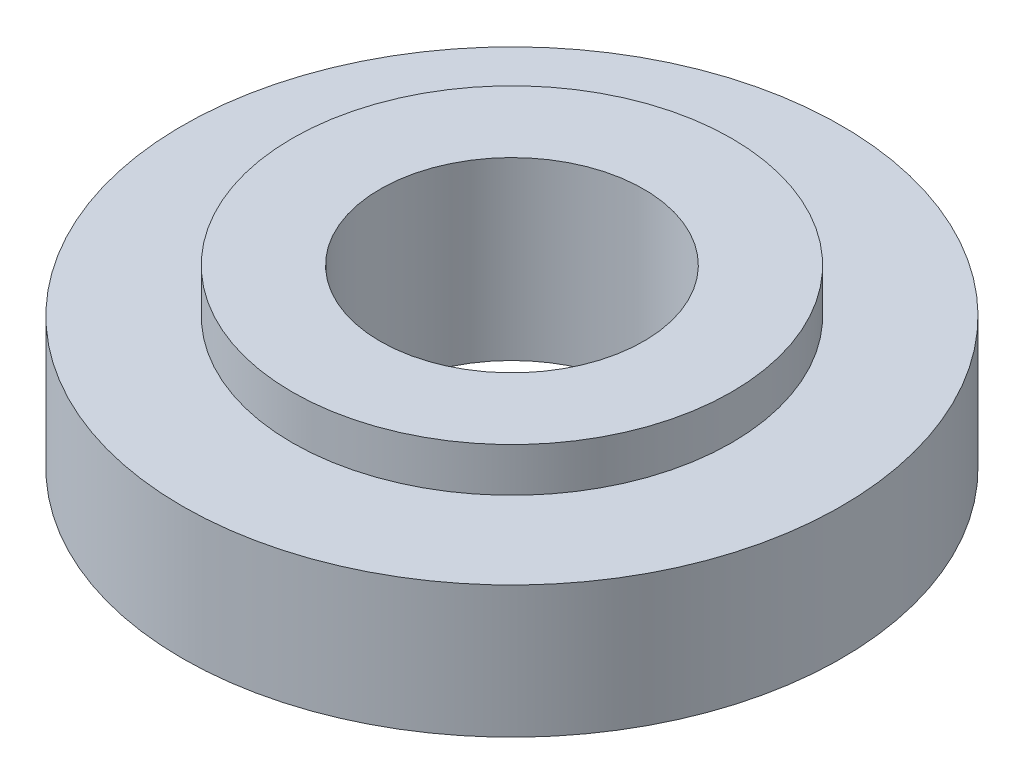
ISO-10303-21;
HEADER;
FILE_DESCRIPTION(('STEP AP214'),'2;1');
FILE_NAME('part.step','',(''),(''),'','','');
FILE_SCHEMA(('AUTOMOTIVE_DESIGN { 1 0 10303 214 1 1 1 1 }'));
ENDSEC;
DATA;
#1=APPLICATION_CONTEXT('core data for automotive mechanical design processes');
#2=APPLICATION_PROTOCOL_DEFINITION('international standard','automotive_design',2000,#1);
#3=PRODUCT_CONTEXT('',#1,'mechanical');
#4=PRODUCT('Part','Part','',(#3));
#5=PRODUCT_RELATED_PRODUCT_CATEGORY('part','',(#4));
#6=PRODUCT_DEFINITION_FORMATION('','',#4);
#7=PRODUCT_DEFINITION_CONTEXT('part definition',#1,'design');
#8=PRODUCT_DEFINITION('design','',#6,#7);
#9=PRODUCT_DEFINITION_SHAPE('','',#8);
#10=(LENGTH_UNIT() NAMED_UNIT(*) SI_UNIT(.MILLI.,.METRE.));
#11=(NAMED_UNIT(*) PLANE_ANGLE_UNIT() SI_UNIT($,.RADIAN.));
#12=(NAMED_UNIT(*) SI_UNIT($,.STERADIAN.) SOLID_ANGLE_UNIT());
#13=UNCERTAINTY_MEASURE_WITH_UNIT(LENGTH_MEASURE(1.E-05),#10,'distance_accuracy_value','');
#14=(GEOMETRIC_REPRESENTATION_CONTEXT(3) GLOBAL_UNCERTAINTY_ASSIGNED_CONTEXT((#13)) GLOBAL_UNIT_ASSIGNED_CONTEXT((#10,
#11,#12)) REPRESENTATION_CONTEXT('',''));
#15=CARTESIAN_POINT('',(0.,0.,0.));
#16=DIRECTION('',(0.,0.,1.));
#17=DIRECTION('',(1.,0.,0.));
#18=AXIS2_PLACEMENT_3D('',#15,#16,#17);
#19=CARTESIAN_POINT('',(0.,-2.06790134706815,0.));
#20=DIRECTION('',(0.,1.,0.));
#21=DIRECTION('',(0.,0.,1.));
#22=AXIS2_PLACEMENT_3D('',#19,#20,#21);
#23=CYLINDRICAL_SURFACE('',#22,2.5005);
#24=CARTESIAN_POINT('',(0.,-2.06790134706815,0.));
#25=DIRECTION('',(0.,1.,0.));
#26=DIRECTION('',(0.,0.,1.));
#27=AXIS2_PLACEMENT_3D('',#24,#25,#26);
#28=CIRCLE('',#27,2.5005);
#29=CARTESIAN_POINT('',(0.,-2.06790134706815,2.5005));
#30=VERTEX_POINT('',#29);
#31=EDGE_CURVE('E46',#30,#30,#28,.T.);
#32=ORIENTED_EDGE('',*,*,#31,.F.);
#33=EDGE_LOOP('',(#32));
#34=FACE_BOUND('',#33,.T.);
#35=CARTESIAN_POINT('',(0.,1.26609865293185,0.));
#36=DIRECTION('',(0.,1.,0.));
#37=DIRECTION('',(0.,0.,1.));
#38=AXIS2_PLACEMENT_3D('',#35,#36,#37);
#39=CIRCLE('',#38,2.5005);
#40=CARTESIAN_POINT('',(0.,1.26609865293185,2.5005));
#41=VERTEX_POINT('',#40);
#42=EDGE_CURVE('E57',#41,#41,#39,.T.);
#43=ORIENTED_EDGE('',*,*,#42,.T.);
#44=EDGE_LOOP('',(#43));
#45=FACE_BOUND('',#44,.T.);
#46=ADVANCED_FACE('F38',(#34,#45),#23,.F.);
#47=CARTESIAN_POINT('',(0.,-2.06790134706815,0.));
#48=DIRECTION('',(0.,1.,0.));
#49=DIRECTION('',(0.,0.,1.));
#50=AXIS2_PLACEMENT_3D('',#47,#48,#49);
#51=CYLINDRICAL_SURFACE('',#50,6.25125);
#52=CARTESIAN_POINT('',(0.,-2.06790134706815,0.));
#53=DIRECTION('',(0.,1.,0.));
#54=DIRECTION('',(0.,0.,1.));
#55=AXIS2_PLACEMENT_3D('',#52,#53,#54);
#56=CIRCLE('',#55,6.25125);
#57=CARTESIAN_POINT('',(0.,-2.06790134706815,6.25125));
#58=VERTEX_POINT('',#57);
#59=EDGE_CURVE('E10',#58,#58,#56,.T.);
#60=ORIENTED_EDGE('',*,*,#59,.T.);
#61=EDGE_LOOP('',(#60));
#62=FACE_BOUND('',#61,.T.);
#63=CARTESIAN_POINT('',(0.,0.432598652931854,0.));
#64=DIRECTION('',(0.,1.,0.));
#65=DIRECTION('',(0.,0.,1.));
#66=AXIS2_PLACEMENT_3D('',#63,#64,#65);
#67=CIRCLE('',#66,6.25125);
#68=CARTESIAN_POINT('',(0.,0.432598652931854,6.25125));
#69=VERTEX_POINT('',#68);
#70=EDGE_CURVE('E41',#69,#69,#67,.T.);
#71=ORIENTED_EDGE('',*,*,#70,.F.);
#72=EDGE_LOOP('',(#71));
#73=FACE_BOUND('',#72,.T.);
#74=ADVANCED_FACE('F88',(#62,#73),#51,.T.);
#75=CARTESIAN_POINT('',(0.,-2.06790134706815,0.));
#76=DIRECTION('',(0.,1.,0.));
#77=DIRECTION('',(0.,0.,1.));
#78=AXIS2_PLACEMENT_3D('',#75,#76,#77);
#79=PLANE('',#78);
#80=ORIENTED_EDGE('',*,*,#31,.T.);
#81=EDGE_LOOP('',(#80));
#82=FACE_BOUND('',#81,.T.);
#83=ORIENTED_EDGE('',*,*,#59,.F.);
#84=EDGE_LOOP('',(#83));
#85=FACE_BOUND('',#84,.T.);
#86=ADVANCED_FACE('F82',(#82,#85),#79,.F.);
#87=CARTESIAN_POINT('',(0.,0.432598652931854,0.));
#88=DIRECTION('',(0.,1.,0.));
#89=DIRECTION('',(0.,0.,1.));
#90=AXIS2_PLACEMENT_3D('',#87,#88,#89);
#91=PLANE('',#90);
#92=CARTESIAN_POINT('',(0.,0.432598652931854,0.));
#93=DIRECTION('',(0.,1.,0.));
#94=DIRECTION('',(0.,0.,1.));
#95=AXIS2_PLACEMENT_3D('',#92,#93,#94);
#96=CIRCLE('',#95,4.1675);
#97=CARTESIAN_POINT('',(0.,0.432598652931854,4.1675));
#98=VERTEX_POINT('',#97);
#99=EDGE_CURVE('E53',#98,#98,#96,.T.);
#100=ORIENTED_EDGE('',*,*,#99,.F.);
#101=EDGE_LOOP('',(#100));
#102=FACE_BOUND('',#101,.T.);
#103=ORIENTED_EDGE('',*,*,#70,.T.);
#104=EDGE_LOOP('',(#103));
#105=FACE_BOUND('',#104,.T.);
#106=ADVANCED_FACE('F76',(#102,#105),#91,.T.);
#107=CARTESIAN_POINT('',(0.,1.26609865293185,0.));
#108=DIRECTION('',(0.,-1.,0.));
#109=DIRECTION('',(0.,0.,-1.));
#110=AXIS2_PLACEMENT_3D('',#107,#108,#109);
#111=CYLINDRICAL_SURFACE('',#110,4.1675);
#112=CARTESIAN_POINT('',(0.,1.26609865293185,0.));
#113=DIRECTION('',(0.,1.,0.));
#114=DIRECTION('',(0.,0.,1.));
#115=AXIS2_PLACEMENT_3D('',#112,#113,#114);
#116=CIRCLE('',#115,4.1675);
#117=CARTESIAN_POINT('',(0.,1.26609865293185,4.1675));
#118=VERTEX_POINT('',#117);
#119=EDGE_CURVE('E58',#118,#118,#116,.T.);
#120=ORIENTED_EDGE('',*,*,#119,.F.);
#121=EDGE_LOOP('',(#120));
#122=FACE_BOUND('',#121,.T.);
#123=ORIENTED_EDGE('',*,*,#99,.T.);
#124=EDGE_LOOP('',(#123));
#125=FACE_BOUND('',#124,.T.);
#126=ADVANCED_FACE('F70',(#122,#125),#111,.T.);
#127=CARTESIAN_POINT('',(0.,1.26609865293185,0.));
#128=DIRECTION('',(0.,1.,0.));
#129=DIRECTION('',(0.,0.,1.));
#130=AXIS2_PLACEMENT_3D('',#127,#128,#129);
#131=PLANE('',#130);
#132=ORIENTED_EDGE('',*,*,#42,.F.);
#133=EDGE_LOOP('',(#132));
#134=FACE_BOUND('',#133,.T.);
#135=ORIENTED_EDGE('',*,*,#119,.T.);
#136=EDGE_LOOP('',(#135));
#137=FACE_BOUND('',#136,.T.);
#138=ADVANCED_FACE('F67',(#134,#137),#131,.T.);
#139=CLOSED_SHELL('',(#46,#74,#86,#106,#126,#138));
#140=MANIFOLD_SOLID_BREP('B2',#139);
#141=ADVANCED_BREP_SHAPE_REPRESENTATION('',(#18,#140),#14);
#142=SHAPE_DEFINITION_REPRESENTATION(#9,#141);
ENDSEC;
END-ISO-10303-21;
